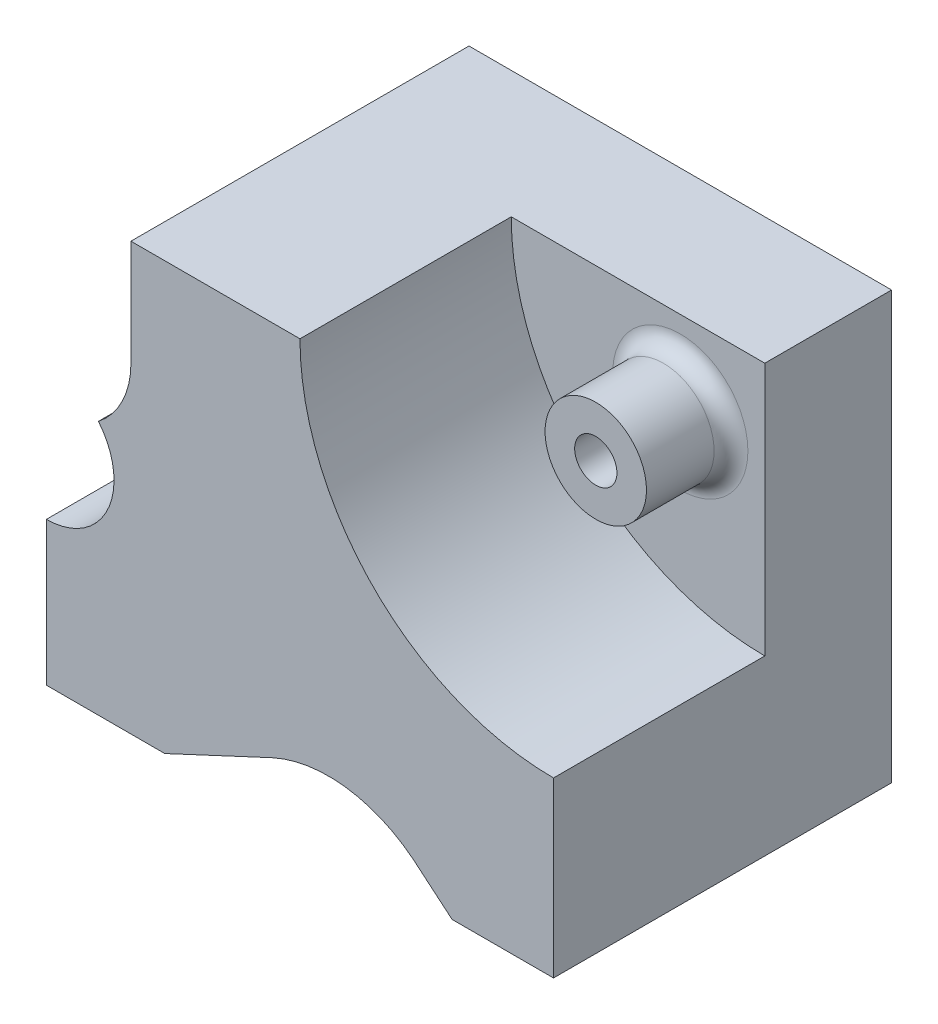
ISO-10303-21;
HEADER;
FILE_DESCRIPTION(('STEP AP214'),'2;1');
FILE_NAME('part.step','',(''),(''),'','','');
FILE_SCHEMA(('AUTOMOTIVE_DESIGN { 1 0 10303 214 1 1 1 1 }'));
ENDSEC;
DATA;
#1=APPLICATION_CONTEXT('core data for automotive mechanical design processes');
#2=APPLICATION_PROTOCOL_DEFINITION('international standard','automotive_design',2000,#1);
#3=PRODUCT_CONTEXT('',#1,'mechanical');
#4=PRODUCT('Part','Part','',(#3));
#5=PRODUCT_RELATED_PRODUCT_CATEGORY('part','',(#4));
#6=PRODUCT_DEFINITION_FORMATION('','',#4);
#7=PRODUCT_DEFINITION_CONTEXT('part definition',#1,'design');
#8=PRODUCT_DEFINITION('design','',#6,#7);
#9=PRODUCT_DEFINITION_SHAPE('','',#8);
#10=(LENGTH_UNIT() NAMED_UNIT(*) SI_UNIT(.MILLI.,.METRE.));
#11=(NAMED_UNIT(*) PLANE_ANGLE_UNIT() SI_UNIT($,.RADIAN.));
#12=(NAMED_UNIT(*) SI_UNIT($,.STERADIAN.) SOLID_ANGLE_UNIT());
#13=UNCERTAINTY_MEASURE_WITH_UNIT(LENGTH_MEASURE(1.E-05),#10,'distance_accuracy_value','');
#14=(GEOMETRIC_REPRESENTATION_CONTEXT(3) GLOBAL_UNCERTAINTY_ASSIGNED_CONTEXT((#13)) GLOBAL_UNIT_ASSIGNED_CONTEXT((#10,
#11,#12)) REPRESENTATION_CONTEXT('',''));
#15=CARTESIAN_POINT('',(0.,0.,0.));
#16=DIRECTION('',(0.,0.,1.));
#17=DIRECTION('',(1.,0.,0.));
#18=AXIS2_PLACEMENT_3D('',#15,#16,#17);
#19=CARTESIAN_POINT('',(0.,0.,-25.));
#20=DIRECTION('',(0.,0.,1.));
#21=DIRECTION('',(1.,0.,0.));
#22=AXIS2_PLACEMENT_3D('',#19,#20,#21);
#23=PLANE('',#22);
#24=CARTESIAN_POINT('',(-10.,-10.,-25.));
#25=DIRECTION('',(0.,0.,1.));
#26=DIRECTION('',(1.,0.,0.));
#27=AXIS2_PLACEMENT_3D('',#24,#25,#26);
#28=CIRCLE('',#27,8.);
#29=CARTESIAN_POINT('',(-2.,-10.,-25.));
#30=VERTEX_POINT('',#29);
#31=EDGE_CURVE('E12',#30,#30,#28,.F.);
#32=ORIENTED_EDGE('',*,*,#31,.T.);
#33=EDGE_LOOP('',(#32));
#34=FACE_BOUND('',#33,.T.);
#35=DIRECTION('',(-1.,0.,0.));
#36=VECTOR('',#35,1.);
#37=CARTESIAN_POINT('',(0.,0.,-25.));
#38=LINE('',#37,#36);
#39=CARTESIAN_POINT('',(0.,0.,-25.));
#40=VERTEX_POINT('',#39);
#41=CARTESIAN_POINT('',(-30.,0.,-25.));
#42=VERTEX_POINT('',#41);
#43=EDGE_CURVE('E211',#40,#42,#38,.T.);
#44=ORIENTED_EDGE('',*,*,#43,.T.);
#45=CARTESIAN_POINT('',(0.,0.,-25.));
#46=DIRECTION('',(0.,0.,1.));
#47=DIRECTION('',(1.,0.,0.));
#48=AXIS2_PLACEMENT_3D('',#45,#46,#47);
#49=CIRCLE('',#48,30.);
#50=CARTESIAN_POINT('',(0.,-30.,-25.));
#51=VERTEX_POINT('',#50);
#52=EDGE_CURVE('E215',#42,#51,#49,.T.);
#53=ORIENTED_EDGE('',*,*,#52,.T.);
#54=DIRECTION('',(0.,1.,0.));
#55=VECTOR('',#54,1.);
#56=CARTESIAN_POINT('',(0.,0.,-25.));
#57=LINE('',#56,#55);
#58=EDGE_CURVE('E219',#51,#40,#57,.T.);
#59=ORIENTED_EDGE('',*,*,#58,.T.);
#60=EDGE_LOOP('',(#44,#53,#59));
#61=FACE_BOUND('',#60,.T.);
#62=ADVANCED_FACE('F45',(#34,#61),#23,.T.);
#63=CARTESIAN_POINT('',(-60.,-12.5,-40.));
#64=DIRECTION('',(-1.,0.,0.));
#65=DIRECTION('',(0.,-1.,0.));
#66=AXIS2_PLACEMENT_3D('',#63,#64,#65);
#67=PLANE('',#66);
#68=DIRECTION('',(0.,0.,1.));
#69=VECTOR('',#68,1.);
#70=CARTESIAN_POINT('',(-60.,-33.5,-15.));
#71=LINE('',#70,#69);
#72=CARTESIAN_POINT('',(-60.,-33.5,-15.));
#73=VERTEX_POINT('',#72);
#74=CARTESIAN_POINT('',(-60.,-33.5,0.));
#75=VERTEX_POINT('',#74);
#76=EDGE_CURVE('E156',#73,#75,#71,.T.);
#77=ORIENTED_EDGE('',*,*,#76,.F.);
#78=DIRECTION('',(0.,-1.,0.));
#79=VECTOR('',#78,1.);
#80=CARTESIAN_POINT('',(-60.,0.,-15.));
#81=LINE('',#80,#79);
#82=CARTESIAN_POINT('',(-60.,-22.5,-15.));
#83=VERTEX_POINT('',#82);
#84=EDGE_CURVE('E163',#83,#73,#81,.T.);
#85=ORIENTED_EDGE('',*,*,#84,.F.);
#86=DIRECTION('',(0.,0.,1.));
#87=VECTOR('',#86,1.);
#88=CARTESIAN_POINT('',(-60.,-22.5,-25.));
#89=LINE('',#88,#87);
#90=CARTESIAN_POINT('',(-60.,-22.5,-25.));
#91=VERTEX_POINT('',#90);
#92=EDGE_CURVE('E204',#91,#83,#89,.T.);
#93=ORIENTED_EDGE('',*,*,#92,.F.);
#94=DIRECTION('',(0.,-1.,0.));
#95=VECTOR('',#94,1.);
#96=CARTESIAN_POINT('',(-60.,0.,-25.));
#97=LINE('',#96,#95);
#98=CARTESIAN_POINT('',(-60.,-12.5,-25.));
#99=VERTEX_POINT('',#98);
#100=EDGE_CURVE('E195',#99,#91,#97,.T.);
#101=ORIENTED_EDGE('',*,*,#100,.F.);
#102=DIRECTION('',(0.,0.,1.));
#103=VECTOR('',#102,1.);
#104=CARTESIAN_POINT('',(-60.,-12.5,-40.));
#105=LINE('',#104,#103);
#106=CARTESIAN_POINT('',(-60.,-12.5,-40.));
#107=VERTEX_POINT('',#106);
#108=EDGE_CURVE('E320',#107,#99,#105,.T.);
#109=ORIENTED_EDGE('',*,*,#108,.F.);
#110=DIRECTION('',(0.,-1.,0.));
#111=VECTOR('',#110,1.);
#112=CARTESIAN_POINT('',(-60.,-12.5,-40.));
#113=LINE('',#112,#111);
#114=CARTESIAN_POINT('',(-60.,-50.5,-40.));
#115=VERTEX_POINT('',#114);
#116=EDGE_CURVE('E246',#107,#115,#113,.T.);
#117=ORIENTED_EDGE('',*,*,#116,.T.);
#118=DIRECTION('',(0.,0.,1.));
#119=VECTOR('',#118,1.);
#120=CARTESIAN_POINT('',(-60.,-50.5,-40.));
#121=LINE('',#120,#119);
#122=CARTESIAN_POINT('',(-60.,-50.5,0.));
#123=VERTEX_POINT('',#122);
#124=EDGE_CURVE('E317',#115,#123,#121,.T.);
#125=ORIENTED_EDGE('',*,*,#124,.T.);
#126=DIRECTION('',(0.,-1.,0.));
#127=VECTOR('',#126,1.);
#128=CARTESIAN_POINT('',(-60.,-12.5,0.));
#129=LINE('',#128,#127);
#130=EDGE_CURVE('E176',#75,#123,#129,.T.);
#131=ORIENTED_EDGE('',*,*,#130,.F.);
#132=EDGE_LOOP('',(#77,#85,#93,#101,#109,#117,#125,#131));
#133=FACE_BOUND('',#132,.T.);
#134=ADVANCED_FACE('F174',(#133),#67,.T.);
#135=CARTESIAN_POINT('',(-50.,-12.5,-40.));
#136=DIRECTION('',(0.,1.,0.));
#137=DIRECTION('',(-1.,0.,0.));
#138=AXIS2_PLACEMENT_3D('',#135,#136,#137);
#139=PLANE('',#138);
#140=ORIENTED_EDGE('',*,*,#108,.T.);
#141=DIRECTION('',(-1.,0.,0.));
#142=VECTOR('',#141,1.);
#143=CARTESIAN_POINT('',(0.,-12.5,-25.));
#144=LINE('',#143,#142);
#145=CARTESIAN_POINT('',(-50.,-12.5,-25.));
#146=VERTEX_POINT('',#145);
#147=EDGE_CURVE('E191',#146,#99,#144,.T.);
#148=ORIENTED_EDGE('',*,*,#147,.F.);
#149=DIRECTION('',(0.,0.,1.));
#150=VECTOR('',#149,1.);
#151=CARTESIAN_POINT('',(-50.,-12.5,-40.));
#152=LINE('',#151,#150);
#153=CARTESIAN_POINT('',(-50.,-12.5,-40.));
#154=VERTEX_POINT('',#153);
#155=EDGE_CURVE('E324',#154,#146,#152,.T.);
#156=ORIENTED_EDGE('',*,*,#155,.F.);
#157=DIRECTION('',(-1.,0.,0.));
#158=VECTOR('',#157,1.);
#159=CARTESIAN_POINT('',(-50.,-12.5,-40.));
#160=LINE('',#159,#158);
#161=EDGE_CURVE('E242',#154,#107,#160,.T.);
#162=ORIENTED_EDGE('',*,*,#161,.T.);
#163=EDGE_LOOP('',(#140,#148,#156,#162));
#164=FACE_BOUND('',#163,.T.);
#165=ADVANCED_FACE('F357',(#164),#139,.T.);
#166=CARTESIAN_POINT('',(-26.6179698005569,-59.1158629319359,0.));
#167=DIRECTION('',(0.,0.,1.));
#168=DIRECTION('',(1.,0.,0.));
#169=AXIS2_PLACEMENT_3D('',#166,#167,#168);
#170=PLANE('',#169);
#171=CARTESIAN_POINT('',(-60.,-25.5,0.));
#172=DIRECTION('',(0.,0.,1.));
#173=DIRECTION('',(1.,0.,0.));
#174=AXIS2_PLACEMENT_3D('',#171,#172,#173);
#175=CIRCLE('',#174,8.);
#176=CARTESIAN_POINT('',(-53.8491593878002,-20.3846153846154,0.));
#177=VERTEX_POINT('',#176);
#178=EDGE_CURVE('E171',#75,#177,#175,.T.);
#179=ORIENTED_EDGE('',*,*,#178,.F.);
#180=ORIENTED_EDGE('',*,*,#130,.T.);
#181=DIRECTION('',(1.,0.,0.));
#182=VECTOR('',#181,1.);
#183=CARTESIAN_POINT('',(-60.,-50.5,0.));
#184=LINE('',#183,#182);
#185=CARTESIAN_POINT('',(-46.,-50.5,0.));
#186=VERTEX_POINT('',#185);
#187=EDGE_CURVE('E283',#123,#186,#184,.T.);
#188=ORIENTED_EDGE('',*,*,#187,.T.);
#189=DIRECTION('',(0.906307787036649,0.422618261740701,0.));
#190=VECTOR('',#189,1.);
#191=CARTESIAN_POINT('',(-46.,-50.5,0.));
#192=LINE('',#191,#190);
#193=CARTESIAN_POINT('',(-33.3116909814869,-44.5833443356302,0.));
#194=VERTEX_POINT('',#193);
#195=EDGE_CURVE('E287',#186,#194,#192,.T.);
#196=ORIENTED_EDGE('',*,*,#195,.T.);
#197=CARTESIAN_POINT('',(-26.6179698005569,-59.1158629319359,0.));
#198=DIRECTION('',(0.,0.,-1.));
#199=DIRECTION('',(1.,0.,0.));
#200=AXIS2_PLACEMENT_3D('',#197,#198,#199);
#201=CIRCLE('',#200,16.);
#202=CARTESIAN_POINT('',(-16.5962666587139,-46.6432743418808,0.));
#203=VERTEX_POINT('',#202);
#204=EDGE_CURVE('E291',#194,#203,#201,.T.);
#205=ORIENTED_EDGE('',*,*,#204,.T.);
#206=DIRECTION('',(0.766044443118977,-0.642787609686541,0.));
#207=VECTOR('',#206,1.);
#208=CARTESIAN_POINT('',(-12.,-50.5,0.));
#209=LINE('',#208,#207);
#210=CARTESIAN_POINT('',(-12.,-50.5,0.));
#211=VERTEX_POINT('',#210);
#212=EDGE_CURVE('E295',#203,#211,#209,.T.);
#213=ORIENTED_EDGE('',*,*,#212,.T.);
#214=DIRECTION('',(1.,0.,0.));
#215=VECTOR('',#214,1.);
#216=CARTESIAN_POINT('',(0.,-50.5,0.));
#217=LINE('',#216,#215);
#218=CARTESIAN_POINT('',(0.,-50.5,0.));
#219=VERTEX_POINT('',#218);
#220=EDGE_CURVE('E234',#211,#219,#217,.T.);
#221=ORIENTED_EDGE('',*,*,#220,.T.);
#222=DIRECTION('',(0.,1.,0.));
#223=VECTOR('',#222,1.);
#224=CARTESIAN_POINT('',(0.,-50.5,0.));
#225=LINE('',#224,#223);
#226=CARTESIAN_POINT('',(0.,-30.,0.));
#227=VERTEX_POINT('',#226);
#228=EDGE_CURVE('E207',#219,#227,#225,.T.);
#229=ORIENTED_EDGE('',*,*,#228,.T.);
#230=CARTESIAN_POINT('',(0.,0.,0.));
#231=DIRECTION('',(0.,0.,1.));
#232=DIRECTION('',(1.,0.,0.));
#233=AXIS2_PLACEMENT_3D('',#230,#231,#232);
#234=CIRCLE('',#233,30.);
#235=CARTESIAN_POINT('',(-30.,0.,0.));
#236=VERTEX_POINT('',#235);
#237=EDGE_CURVE('E183',#236,#227,#234,.T.);
#238=ORIENTED_EDGE('',*,*,#237,.F.);
#239=DIRECTION('',(-1.,0.,0.));
#240=VECTOR('',#239,1.);
#241=CARTESIAN_POINT('',(0.,0.,0.));
#242=LINE('',#241,#240);
#243=CARTESIAN_POINT('',(-50.,0.,0.));
#244=VERTEX_POINT('',#243);
#245=EDGE_CURVE('E274',#236,#244,#242,.T.);
#246=ORIENTED_EDGE('',*,*,#245,.T.);
#247=DIRECTION('',(0.,-1.,0.));
#248=VECTOR('',#247,1.);
#249=CARTESIAN_POINT('',(-50.,0.,0.));
#250=LINE('',#249,#248);
#251=CARTESIAN_POINT('',(-50.,-12.5,0.));
#252=VERTEX_POINT('',#251);
#253=EDGE_CURVE('E277',#244,#252,#250,.T.);
#254=ORIENTED_EDGE('',*,*,#253,.T.);
#255=CARTESIAN_POINT('',(-60.,-12.5,0.));
#256=DIRECTION('',(0.,0.,1.));
#257=DIRECTION('',(1.,0.,0.));
#258=AXIS2_PLACEMENT_3D('',#255,#256,#257);
#259=CIRCLE('',#258,10.);
#260=EDGE_CURVE('E192',#252,#177,#259,.F.);
#261=ORIENTED_EDGE('',*,*,#260,.T.);
#262=EDGE_LOOP('',(#179,#180,#188,#196,#205,#213,#221,#229,#238,#246,#254,#261));
#263=FACE_BOUND('',#262,.T.);
#264=ADVANCED_FACE('F372',(#263),#170,.T.);
#265=CARTESIAN_POINT('',(0.,-50.5,-40.));
#266=DIRECTION('',(1.,0.,0.));
#267=DIRECTION('',(0.,0.,-1.));
#268=AXIS2_PLACEMENT_3D('',#265,#266,#267);
#269=PLANE('',#268);
#270=DIRECTION('',(0.,0.,1.));
#271=VECTOR('',#270,1.);
#272=CARTESIAN_POINT('',(0.,-30.,-25.));
#273=LINE('',#272,#271);
#274=EDGE_CURVE('E203',#51,#227,#273,.T.);
#275=ORIENTED_EDGE('',*,*,#274,.T.);
#276=ORIENTED_EDGE('',*,*,#228,.F.);
#277=DIRECTION('',(0.,0.,1.));
#278=VECTOR('',#277,1.);
#279=CARTESIAN_POINT('',(0.,-50.5,-40.));
#280=LINE('',#279,#278);
#281=CARTESIAN_POINT('',(0.,-50.5,-40.));
#282=VERTEX_POINT('',#281);
#283=EDGE_CURVE('E302',#282,#219,#280,.T.);
#284=ORIENTED_EDGE('',*,*,#283,.F.);
#285=DIRECTION('',(0.,1.,0.));
#286=VECTOR('',#285,1.);
#287=CARTESIAN_POINT('',(0.,-50.5,-40.));
#288=LINE('',#287,#286);
#289=CARTESIAN_POINT('',(0.,0.,-40.));
#290=VERTEX_POINT('',#289);
#291=EDGE_CURVE('E229',#282,#290,#288,.T.);
#292=ORIENTED_EDGE('',*,*,#291,.T.);
#293=DIRECTION('',(0.,0.,1.));
#294=VECTOR('',#293,1.);
#295=CARTESIAN_POINT('',(0.,0.,-40.));
#296=LINE('',#295,#294);
#297=EDGE_CURVE('E270',#290,#40,#296,.T.);
#298=ORIENTED_EDGE('',*,*,#297,.T.);
#299=ORIENTED_EDGE('',*,*,#58,.F.);
#300=EDGE_LOOP('',(#275,#276,#284,#292,#298,#299));
#301=FACE_BOUND('',#300,.T.);
#302=ADVANCED_FACE('F375',(#301),#269,.T.);
#303=CARTESIAN_POINT('',(0.,-50.5,-40.));
#304=DIRECTION('',(0.,-1.,0.));
#305=DIRECTION('',(0.,0.,-1.));
#306=AXIS2_PLACEMENT_3D('',#303,#304,#305);
#307=PLANE('',#306);
#308=ORIENTED_EDGE('',*,*,#220,.F.);
#309=DIRECTION('',(0.,0.,1.));
#310=VECTOR('',#309,1.);
#311=CARTESIAN_POINT('',(-12.,-50.5,-40.));
#312=LINE('',#311,#310);
#313=CARTESIAN_POINT('',(-12.,-50.5,-40.));
#314=VERTEX_POINT('',#313);
#315=EDGE_CURVE('E305',#314,#211,#312,.T.);
#316=ORIENTED_EDGE('',*,*,#315,.F.);
#317=DIRECTION('',(1.,0.,0.));
#318=VECTOR('',#317,1.);
#319=CARTESIAN_POINT('',(0.,-50.5,-40.));
#320=LINE('',#319,#318);
#321=EDGE_CURVE('E266',#314,#282,#320,.T.);
#322=ORIENTED_EDGE('',*,*,#321,.T.);
#323=ORIENTED_EDGE('',*,*,#283,.T.);
#324=EDGE_LOOP('',(#308,#316,#322,#323));
#325=FACE_BOUND('',#324,.T.);
#326=ADVANCED_FACE('F377',(#325),#307,.T.);
#327=CARTESIAN_POINT('',(-12.,-50.5,-40.));
#328=DIRECTION('',(-0.642787609686541,-0.766044443118977,0.));
#329=DIRECTION('',(0.766044443118977,-0.642787609686541,0.));
#330=AXIS2_PLACEMENT_3D('',#327,#328,#329);
#331=PLANE('',#330);
#332=ORIENTED_EDGE('',*,*,#212,.F.);
#333=DIRECTION('',(0.,0.,1.));
#334=VECTOR('',#333,1.);
#335=CARTESIAN_POINT('',(-16.5962666587139,-46.6432743418808,-40.));
#336=LINE('',#335,#334);
#337=CARTESIAN_POINT('',(-16.5962666587139,-46.6432743418808,-40.));
#338=VERTEX_POINT('',#337);
#339=EDGE_CURVE('E308',#338,#203,#336,.T.);
#340=ORIENTED_EDGE('',*,*,#339,.F.);
#341=DIRECTION('',(0.766044443118977,-0.642787609686541,0.));
#342=VECTOR('',#341,1.);
#343=CARTESIAN_POINT('',(-12.,-50.5,-40.));
#344=LINE('',#343,#342);
#345=EDGE_CURVE('E262',#338,#314,#344,.T.);
#346=ORIENTED_EDGE('',*,*,#345,.T.);
#347=ORIENTED_EDGE('',*,*,#315,.T.);
#348=EDGE_LOOP('',(#332,#340,#346,#347));
#349=FACE_BOUND('',#348,.T.);
#350=ADVANCED_FACE('F380',(#349),#331,.T.);
#351=CARTESIAN_POINT('',(-26.6179698005569,-59.1158629319359,-40.));
#352=DIRECTION('',(0.,0.,1.));
#353=DIRECTION('',(1.,0.,0.));
#354=AXIS2_PLACEMENT_3D('',#351,#352,#353);
#355=CYLINDRICAL_SURFACE('',#354,16.);
#356=ORIENTED_EDGE('',*,*,#204,.F.);
#357=DIRECTION('',(0.,0.,1.));
#358=VECTOR('',#357,1.);
#359=CARTESIAN_POINT('',(-33.3116909814869,-44.5833443356302,-40.));
#360=LINE('',#359,#358);
#361=CARTESIAN_POINT('',(-33.3116909814869,-44.5833443356302,-40.));
#362=VERTEX_POINT('',#361);
#363=EDGE_CURVE('E311',#362,#194,#360,.T.);
#364=ORIENTED_EDGE('',*,*,#363,.F.);
#365=CARTESIAN_POINT('',(-26.6179698005569,-59.1158629319359,-40.));
#366=DIRECTION('',(0.,0.,-1.));
#367=DIRECTION('',(1.,0.,0.));
#368=AXIS2_PLACEMENT_3D('',#365,#366,#367);
#369=CIRCLE('',#368,16.);
#370=EDGE_CURVE('E258',#362,#338,#369,.T.);
#371=ORIENTED_EDGE('',*,*,#370,.T.);
#372=ORIENTED_EDGE('',*,*,#339,.T.);
#373=EDGE_LOOP('',(#356,#364,#371,#372));
#374=FACE_BOUND('',#373,.T.);
#375=ADVANCED_FACE('F384',(#374),#355,.F.);
#376=CARTESIAN_POINT('',(-46.,-50.5,-40.));
#377=DIRECTION('',(0.422618261740701,-0.906307787036649,0.));
#378=DIRECTION('',(0.906307787036649,0.422618261740701,0.));
#379=AXIS2_PLACEMENT_3D('',#376,#377,#378);
#380=PLANE('',#379);
#381=ORIENTED_EDGE('',*,*,#195,.F.);
#382=DIRECTION('',(0.,0.,1.));
#383=VECTOR('',#382,1.);
#384=CARTESIAN_POINT('',(-46.,-50.5,-40.));
#385=LINE('',#384,#383);
#386=CARTESIAN_POINT('',(-46.,-50.5,-40.));
#387=VERTEX_POINT('',#386);
#388=EDGE_CURVE('E314',#387,#186,#385,.T.);
#389=ORIENTED_EDGE('',*,*,#388,.F.);
#390=DIRECTION('',(0.906307787036649,0.422618261740701,0.));
#391=VECTOR('',#390,1.);
#392=CARTESIAN_POINT('',(-46.,-50.5,-40.));
#393=LINE('',#392,#391);
#394=EDGE_CURVE('E254',#387,#362,#393,.T.);
#395=ORIENTED_EDGE('',*,*,#394,.T.);
#396=ORIENTED_EDGE('',*,*,#363,.T.);
#397=EDGE_LOOP('',(#381,#389,#395,#396));
#398=FACE_BOUND('',#397,.T.);
#399=ADVANCED_FACE('F388',(#398),#380,.T.);
#400=CARTESIAN_POINT('',(-60.,-50.5,-40.));
#401=DIRECTION('',(0.,-1.,0.));
#402=DIRECTION('',(0.,0.,-1.));
#403=AXIS2_PLACEMENT_3D('',#400,#401,#402);
#404=PLANE('',#403);
#405=ORIENTED_EDGE('',*,*,#187,.F.);
#406=ORIENTED_EDGE('',*,*,#124,.F.);
#407=DIRECTION('',(1.,0.,0.));
#408=VECTOR('',#407,1.);
#409=CARTESIAN_POINT('',(-60.,-50.5,-40.));
#410=LINE('',#409,#408);
#411=EDGE_CURVE('E250',#115,#387,#410,.T.);
#412=ORIENTED_EDGE('',*,*,#411,.T.);
#413=ORIENTED_EDGE('',*,*,#388,.T.);
#414=EDGE_LOOP('',(#405,#406,#412,#413));
#415=FACE_BOUND('',#414,.T.);
#416=ADVANCED_FACE('F392',(#415),#404,.T.);
#417=CARTESIAN_POINT('',(-50.,0.,-40.));
#418=DIRECTION('',(-1.,0.,0.));
#419=DIRECTION('',(0.,0.,1.));
#420=AXIS2_PLACEMENT_3D('',#417,#418,#419);
#421=PLANE('',#420);
#422=ORIENTED_EDGE('',*,*,#253,.F.);
#423=DIRECTION('',(0.,0.,1.));
#424=VECTOR('',#423,1.);
#425=CARTESIAN_POINT('',(-50.,0.,-40.));
#426=LINE('',#425,#424);
#427=CARTESIAN_POINT('',(-50.,0.,-40.));
#428=VERTEX_POINT('',#427);
#429=EDGE_CURVE('E328',#428,#244,#426,.T.);
#430=ORIENTED_EDGE('',*,*,#429,.F.);
#431=DIRECTION('',(0.,-1.,0.));
#432=VECTOR('',#431,1.);
#433=CARTESIAN_POINT('',(-50.,0.,-40.));
#434=LINE('',#433,#432);
#435=EDGE_CURVE('E238',#428,#154,#434,.T.);
#436=ORIENTED_EDGE('',*,*,#435,.T.);
#437=ORIENTED_EDGE('',*,*,#155,.T.);
#438=DIRECTION('',(0.,0.,1.));
#439=VECTOR('',#438,1.);
#440=CARTESIAN_POINT('',(-50.,-12.5,-25.));
#441=LINE('',#440,#439);
#442=EDGE_CURVE('E199',#146,#252,#441,.T.);
#443=ORIENTED_EDGE('',*,*,#442,.T.);
#444=EDGE_LOOP('',(#422,#430,#436,#437,#443));
#445=FACE_BOUND('',#444,.T.);
#446=ADVANCED_FACE('F395',(#445),#421,.T.);
#447=CARTESIAN_POINT('',(0.,0.,-40.));
#448=DIRECTION('',(0.,1.,0.));
#449=DIRECTION('',(0.,0.,1.));
#450=AXIS2_PLACEMENT_3D('',#447,#448,#449);
#451=PLANE('',#450);
#452=DIRECTION('',(0.,0.,1.));
#453=VECTOR('',#452,1.);
#454=CARTESIAN_POINT('',(-30.,0.,-25.));
#455=LINE('',#454,#453);
#456=EDGE_CURVE('E69',#42,#236,#455,.T.);
#457=ORIENTED_EDGE('',*,*,#456,.F.);
#458=ORIENTED_EDGE('',*,*,#43,.F.);
#459=ORIENTED_EDGE('',*,*,#297,.F.);
#460=DIRECTION('',(-1.,0.,0.));
#461=VECTOR('',#460,1.);
#462=CARTESIAN_POINT('',(0.,0.,-40.));
#463=LINE('',#462,#461);
#464=EDGE_CURVE('E233',#290,#428,#463,.T.);
#465=ORIENTED_EDGE('',*,*,#464,.T.);
#466=ORIENTED_EDGE('',*,*,#429,.T.);
#467=ORIENTED_EDGE('',*,*,#245,.F.);
#468=EDGE_LOOP('',(#457,#458,#459,#465,#466,#467));
#469=FACE_BOUND('',#468,.T.);
#470=ADVANCED_FACE('F370',(#469),#451,.T.);
#471=CARTESIAN_POINT('',(-26.6179698005569,-59.1158629319359,-40.));
#472=DIRECTION('',(0.,0.,1.));
#473=DIRECTION('',(1.,0.,0.));
#474=AXIS2_PLACEMENT_3D('',#471,#472,#473);
#475=PLANE('',#474);
#476=CARTESIAN_POINT('',(-10.,-10.,-40.));
#477=DIRECTION('',(0.,0.,1.));
#478=DIRECTION('',(1.,0.,0.));
#479=AXIS2_PLACEMENT_3D('',#476,#477,#478);
#480=CIRCLE('',#479,2.5);
#481=CARTESIAN_POINT('',(-7.5,-10.,-40.));
#482=VERTEX_POINT('',#481);
#483=EDGE_CURVE('E437',#482,#482,#480,.T.);
#484=ORIENTED_EDGE('',*,*,#483,.T.);
#485=EDGE_LOOP('',(#484));
#486=FACE_BOUND('',#485,.T.);
#487=ORIENTED_EDGE('',*,*,#291,.F.);
#488=ORIENTED_EDGE('',*,*,#321,.F.);
#489=ORIENTED_EDGE('',*,*,#345,.F.);
#490=ORIENTED_EDGE('',*,*,#370,.F.);
#491=ORIENTED_EDGE('',*,*,#394,.F.);
#492=ORIENTED_EDGE('',*,*,#411,.F.);
#493=ORIENTED_EDGE('',*,*,#116,.F.);
#494=ORIENTED_EDGE('',*,*,#161,.F.);
#495=ORIENTED_EDGE('',*,*,#435,.F.);
#496=ORIENTED_EDGE('',*,*,#464,.F.);
#497=EDGE_LOOP('',(#487,#488,#489,#490,#491,#492,#493,#494,#495,#496));
#498=FACE_BOUND('',#497,.T.);
#499=ADVANCED_FACE('F367',(#486,#498),#475,.F.);
#500=CARTESIAN_POINT('',(0.,0.,-25.));
#501=DIRECTION('',(0.,0.,1.));
#502=DIRECTION('',(1.,0.,0.));
#503=AXIS2_PLACEMENT_3D('',#500,#501,#502);
#504=CYLINDRICAL_SURFACE('',#503,30.);
#505=ORIENTED_EDGE('',*,*,#237,.T.);
#506=ORIENTED_EDGE('',*,*,#274,.F.);
#507=ORIENTED_EDGE('',*,*,#52,.F.);
#508=ORIENTED_EDGE('',*,*,#456,.T.);
#509=EDGE_LOOP('',(#505,#506,#507,#508));
#510=FACE_BOUND('',#509,.T.);
#511=ADVANCED_FACE('F364',(#510),#504,.F.);
#512=CARTESIAN_POINT('',(-60.,-12.5,-25.));
#513=DIRECTION('',(0.,0.,1.));
#514=DIRECTION('',(1.,0.,0.));
#515=AXIS2_PLACEMENT_3D('',#512,#513,#514);
#516=CYLINDRICAL_SURFACE('',#515,10.);
#517=DIRECTION('',(0.,0.,1.));
#518=VECTOR('',#517,1.);
#519=CARTESIAN_POINT('',(-53.8491593878002,-20.3846153846154,-15.));
#520=LINE('',#519,#518);
#521=CARTESIAN_POINT('',(-53.8491593878002,-20.3846153846154,-15.));
#522=VERTEX_POINT('',#521);
#523=EDGE_CURVE('E159',#522,#177,#520,.T.);
#524=ORIENTED_EDGE('',*,*,#523,.T.);
#525=ORIENTED_EDGE('',*,*,#260,.F.);
#526=ORIENTED_EDGE('',*,*,#442,.F.);
#527=CARTESIAN_POINT('',(-60.,-12.5,-25.));
#528=DIRECTION('',(0.,0.,1.));
#529=DIRECTION('',(1.,0.,0.));
#530=AXIS2_PLACEMENT_3D('',#527,#528,#529);
#531=CIRCLE('',#530,10.);
#532=EDGE_CURVE('E188',#146,#91,#531,.F.);
#533=ORIENTED_EDGE('',*,*,#532,.T.);
#534=ORIENTED_EDGE('',*,*,#92,.T.);
#535=CARTESIAN_POINT('',(-60.,-12.5,-15.));
#536=DIRECTION('',(0.,0.,1.));
#537=DIRECTION('',(1.,0.,0.));
#538=AXIS2_PLACEMENT_3D('',#535,#536,#537);
#539=CIRCLE('',#538,10.);
#540=EDGE_CURVE('E162',#522,#83,#539,.F.);
#541=ORIENTED_EDGE('',*,*,#540,.F.);
#542=EDGE_LOOP('',(#524,#525,#526,#533,#534,#541));
#543=FACE_BOUND('',#542,.T.);
#544=ADVANCED_FACE('F362',(#543),#516,.F.);
#545=CARTESIAN_POINT('',(0.,0.,-25.));
#546=DIRECTION('',(0.,0.,1.));
#547=DIRECTION('',(1.,0.,0.));
#548=AXIS2_PLACEMENT_3D('',#545,#546,#547);
#549=PLANE('',#548);
#550=ORIENTED_EDGE('',*,*,#532,.F.);
#551=ORIENTED_EDGE('',*,*,#147,.T.);
#552=ORIENTED_EDGE('',*,*,#100,.T.);
#553=EDGE_LOOP('',(#550,#551,#552));
#554=FACE_BOUND('',#553,.T.);
#555=ADVANCED_FACE('F428',(#554),#549,.T.);
#556=CARTESIAN_POINT('',(-60.,-25.5,-15.));
#557=DIRECTION('',(0.,0.,1.));
#558=DIRECTION('',(1.,0.,0.));
#559=AXIS2_PLACEMENT_3D('',#556,#557,#558);
#560=CYLINDRICAL_SURFACE('',#559,8.);
#561=ORIENTED_EDGE('',*,*,#178,.T.);
#562=ORIENTED_EDGE('',*,*,#523,.F.);
#563=CARTESIAN_POINT('',(-60.,-25.5,-15.));
#564=DIRECTION('',(0.,0.,1.));
#565=DIRECTION('',(1.,0.,0.));
#566=AXIS2_PLACEMENT_3D('',#563,#564,#565);
#567=CIRCLE('',#566,8.);
#568=EDGE_CURVE('E61',#73,#522,#567,.T.);
#569=ORIENTED_EDGE('',*,*,#568,.F.);
#570=ORIENTED_EDGE('',*,*,#76,.T.);
#571=EDGE_LOOP('',(#561,#562,#569,#570));
#572=FACE_BOUND('',#571,.T.);
#573=ADVANCED_FACE('F154',(#572),#560,.F.);
#574=CARTESIAN_POINT('',(0.,0.,-15.));
#575=DIRECTION('',(0.,0.,1.));
#576=DIRECTION('',(1.,0.,0.));
#577=AXIS2_PLACEMENT_3D('',#574,#575,#576);
#578=PLANE('',#577);
#579=ORIENTED_EDGE('',*,*,#84,.T.);
#580=ORIENTED_EDGE('',*,*,#568,.T.);
#581=ORIENTED_EDGE('',*,*,#540,.T.);
#582=EDGE_LOOP('',(#579,#580,#581));
#583=FACE_BOUND('',#582,.T.);
#584=ADVANCED_FACE('F166',(#583),#578,.T.);
#585=CARTESIAN_POINT('',(-10.,-10.,-40.));
#586=DIRECTION('',(0.,0.,1.));
#587=DIRECTION('',(1.,0.,0.));
#588=AXIS2_PLACEMENT_3D('',#585,#586,#587);
#589=CYLINDRICAL_SURFACE('',#588,2.5);
#590=ORIENTED_EDGE('',*,*,#483,.F.);
#591=EDGE_LOOP('',(#590));
#592=FACE_BOUND('',#591,.T.);
#593=CARTESIAN_POINT('',(-10.,-10.,-15.));
#594=DIRECTION('',(0.,0.,1.));
#595=DIRECTION('',(1.,0.,0.));
#596=AXIS2_PLACEMENT_3D('',#593,#594,#595);
#597=CIRCLE('',#596,2.5);
#598=CARTESIAN_POINT('',(-7.5,-10.,-15.));
#599=VERTEX_POINT('',#598);
#600=EDGE_CURVE('E448',#599,#599,#597,.T.);
#601=ORIENTED_EDGE('',*,*,#600,.T.);
#602=EDGE_LOOP('',(#601));
#603=FACE_BOUND('',#602,.T.);
#604=ADVANCED_FACE('F455',(#592,#603),#589,.F.);
#605=CARTESIAN_POINT('',(-10.,-10.,-15.));
#606=DIRECTION('',(0.,0.,1.));
#607=DIRECTION('',(1.,0.,0.));
#608=AXIS2_PLACEMENT_3D('',#605,#606,#607);
#609=PLANE('',#608);
#610=CARTESIAN_POINT('',(-10.,-10.,-15.));
#611=DIRECTION('',(0.,0.,1.));
#612=DIRECTION('',(1.,0.,0.));
#613=AXIS2_PLACEMENT_3D('',#610,#611,#612);
#614=CIRCLE('',#613,6.);
#615=CARTESIAN_POINT('',(-4.,-10.,-15.));
#616=VERTEX_POINT('',#615);
#617=EDGE_CURVE('E442',#616,#616,#614,.T.);
#618=ORIENTED_EDGE('',*,*,#617,.T.);
#619=EDGE_LOOP('',(#618));
#620=FACE_BOUND('',#619,.T.);
#621=ORIENTED_EDGE('',*,*,#600,.F.);
#622=EDGE_LOOP('',(#621));
#623=FACE_BOUND('',#622,.T.);
#624=ADVANCED_FACE('F348',(#620,#623),#609,.T.);
#625=CARTESIAN_POINT('',(-10.,-10.,-15.));
#626=DIRECTION('',(0.,0.,-1.));
#627=DIRECTION('',(-1.,0.,0.));
#628=AXIS2_PLACEMENT_3D('',#625,#626,#627);
#629=CYLINDRICAL_SURFACE('',#628,6.);
#630=CARTESIAN_POINT('',(-10.,-10.,-23.));
#631=DIRECTION('',(0.,0.,1.));
#632=DIRECTION('',(1.,0.,0.));
#633=AXIS2_PLACEMENT_3D('',#630,#631,#632);
#634=CIRCLE('',#633,6.);
#635=CARTESIAN_POINT('',(-4.,-10.,-23.));
#636=VERTEX_POINT('',#635);
#637=EDGE_CURVE('E54',#636,#636,#634,.T.);
#638=ORIENTED_EDGE('',*,*,#637,.T.);
#639=EDGE_LOOP('',(#638));
#640=FACE_BOUND('',#639,.T.);
#641=ORIENTED_EDGE('',*,*,#617,.F.);
#642=EDGE_LOOP('',(#641));
#643=FACE_BOUND('',#642,.T.);
#644=ADVANCED_FACE('F340',(#640,#643),#629,.T.);
#645=CARTESIAN_POINT('',(-10.,-10.,-23.));
#646=DIRECTION('',(0.,0.,1.));
#647=DIRECTION('',(1.,0.,0.));
#648=AXIS2_PLACEMENT_3D('',#645,#646,#647);
#649=TOROIDAL_SURFACE('',#648,8.,2.);
#650=ORIENTED_EDGE('',*,*,#31,.F.);
#651=EDGE_LOOP('',(#650));
#652=FACE_BOUND('',#651,.T.);
#653=ORIENTED_EDGE('',*,*,#637,.F.);
#654=EDGE_LOOP('',(#653));
#655=FACE_BOUND('',#654,.T.);
#656=ADVANCED_FACE('F47',(#652,#655),#649,.F.);
#657=CLOSED_SHELL('',(#62,#134,#165,#264,#302,#326,#350,#375,#399,#416,#446,#470,#499,#511,#544,
#555,#573,#584,#604,#624,#644,#656));
#658=MANIFOLD_SOLID_BREP('B2',#657);
#659=ADVANCED_BREP_SHAPE_REPRESENTATION('',(#18,#658),#14);
#660=SHAPE_DEFINITION_REPRESENTATION(#9,#659);
ENDSEC;
END-ISO-10303-21;
